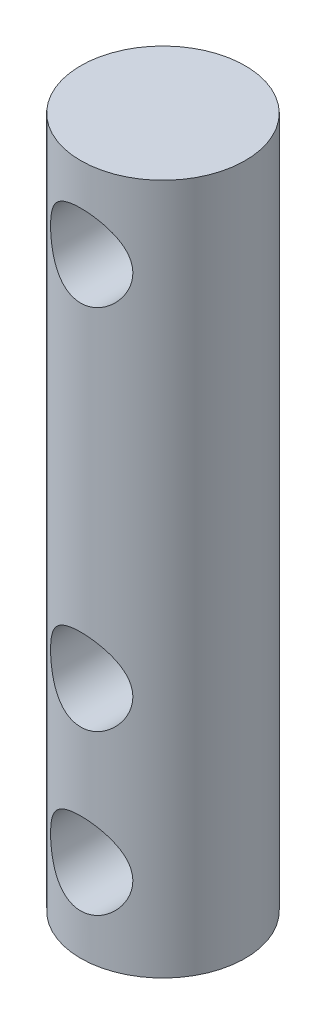
ISO-10303-21;
HEADER;
FILE_DESCRIPTION(('STEP AP214'),'2;1');
FILE_NAME('part.step','',(''),(''),'','','');
FILE_SCHEMA(('AUTOMOTIVE_DESIGN { 1 0 10303 214 1 1 1 1 }'));
ENDSEC;
DATA;
#1=APPLICATION_CONTEXT('core data for automotive mechanical design processes');
#2=APPLICATION_PROTOCOL_DEFINITION('international standard','automotive_design',2000,#1);
#3=PRODUCT_CONTEXT('',#1,'mechanical');
#4=PRODUCT('Part','Part','',(#3));
#5=PRODUCT_RELATED_PRODUCT_CATEGORY('part','',(#4));
#6=PRODUCT_DEFINITION_FORMATION('','',#4);
#7=PRODUCT_DEFINITION_CONTEXT('part definition',#1,'design');
#8=PRODUCT_DEFINITION('design','',#6,#7);
#9=PRODUCT_DEFINITION_SHAPE('','',#8);
#10=(LENGTH_UNIT() NAMED_UNIT(*) SI_UNIT(.MILLI.,.METRE.));
#11=(NAMED_UNIT(*) PLANE_ANGLE_UNIT() SI_UNIT($,.RADIAN.));
#12=(NAMED_UNIT(*) SI_UNIT($,.STERADIAN.) SOLID_ANGLE_UNIT());
#13=UNCERTAINTY_MEASURE_WITH_UNIT(LENGTH_MEASURE(1.E-05),#10,'distance_accuracy_value','');
#14=(GEOMETRIC_REPRESENTATION_CONTEXT(3) GLOBAL_UNCERTAINTY_ASSIGNED_CONTEXT((#13)) GLOBAL_UNIT_ASSIGNED_CONTEXT((#10,
#11,#12)) REPRESENTATION_CONTEXT('',''));
#15=CARTESIAN_POINT('',(0.,0.,0.));
#16=DIRECTION('',(0.,0.,1.));
#17=DIRECTION('',(1.,0.,0.));
#18=AXIS2_PLACEMENT_3D('',#15,#16,#17);
#19=CARTESIAN_POINT('',(0.,21.,0.));
#20=DIRECTION('',(0.,-1.,0.));
#21=DIRECTION('',(0.,0.,-1.));
#22=AXIS2_PLACEMENT_3D('',#19,#20,#21);
#23=CYLINDRICAL_SURFACE('',#22,2.5);
#24=CARTESIAN_POINT('',(0.,19.75,-2.5));
#25=CARTESIAN_POINT('',(-0.0657149536912332,19.7499958721006,-2.49999641755189));
#26=CARTESIAN_POINT('',(-0.131508249622541,19.7447874085979,-2.49738113774397));
#27=CARTESIAN_POINT('',(-0.261150294085531,19.7241838995739,-2.48717695046745));
#28=CARTESIAN_POINT('',(-0.32499510839188,19.7087695087529,-2.47957859786229));
#29=CARTESIAN_POINT('',(-0.448666931100719,19.668507739229,-2.46020349254139));
#30=CARTESIAN_POINT('',(-0.508508503673976,19.64369701969,-2.448442989719));
#31=CARTESIAN_POINT('',(-0.623090771008207,19.5855367232938,-2.42182220644723));
#32=CARTESIAN_POINT('',(-0.677831867487563,19.5521878196889,-2.40696217041912));
#33=CARTESIAN_POINT('',(-0.7843847722024,19.4756034381434,-2.37445322822571));
#34=CARTESIAN_POINT('',(-0.835819013902642,19.4318919009505,-2.3566899890942));
#35=CARTESIAN_POINT('',(-0.930974306083724,19.3368481509412,-2.3207496280843));
#36=CARTESIAN_POINT('',(-0.974689478883459,19.2855101852845,-2.30257220261294));
#37=CARTESIAN_POINT('',(-1.05656500056285,19.1718958130958,-2.26623688996684));
#38=CARTESIAN_POINT('',(-1.09403166943955,19.1090798770676,-2.24818983712665));
#39=CARTESIAN_POINT('',(-1.15771028361337,18.9770408300172,-2.21607473465401));
#40=CARTESIAN_POINT('',(-1.18393026870792,18.9078223390966,-2.20200384508737));
#41=CARTESIAN_POINT('',(-1.22266555273574,18.7691686182226,-2.18072333797261));
#42=CARTESIAN_POINT('',(-1.23590732135055,18.6999944349158,-2.17315339479642));
#43=CARTESIAN_POINT('',(-1.25053374163606,18.5600264527757,-2.1647736243566));
#44=CARTESIAN_POINT('',(-1.25193011046634,18.4892343239111,-2.1639571167911));
#45=CARTESIAN_POINT('',(-1.24335910896537,18.3571424696058,-2.1688866282156));
#46=CARTESIAN_POINT('',(-1.23473069942103,18.2957199609712,-2.17385954577517));
#47=CARTESIAN_POINT('',(-1.20867481132117,18.1753476132837,-2.18845285917313));
#48=CARTESIAN_POINT('',(-1.19124452987206,18.1163985683684,-2.1980747353972));
#49=CARTESIAN_POINT('',(-1.1477622254825,18.0009635842929,-2.22109345515926));
#50=CARTESIAN_POINT('',(-1.12151883389499,17.9445670015178,-2.23457300829998));
#51=CARTESIAN_POINT('',(-1.061302109585,17.8367071342625,-2.26379255351755));
#52=CARTESIAN_POINT('',(-1.02732530476558,17.7852460804999,-2.27953355975238));
#53=CARTESIAN_POINT('',(-0.947582568640986,17.681848434071,-2.31391447379107));
#54=CARTESIAN_POINT('',(-0.900868072961603,17.6306789080298,-2.33266887795933));
#55=CARTESIAN_POINT('',(-0.799444473426718,17.5365807267614,-2.36934529125509));
#56=CARTESIAN_POINT('',(-0.744731570717857,17.4936560099577,-2.38726689948501));
#57=CARTESIAN_POINT('',(-0.62564563228981,17.4153929237128,-2.42127484103705));
#58=CARTESIAN_POINT('',(-0.56094198949926,17.3804994094428,-2.43723730202509));
#59=CARTESIAN_POINT('',(-0.425582769360995,17.3223787136962,-2.46447351401553));
#60=CARTESIAN_POINT('',(-0.354931970331595,17.299142268731,-2.47575098679441));
#61=CARTESIAN_POINT('',(-0.215958114575878,17.2669057453542,-2.49155417176795));
#62=CARTESIAN_POINT('',(-0.147926913185406,17.2568859553165,-2.4965617287664));
#63=CARTESIAN_POINT('',(-0.0109744999366928,17.2481690860819,-2.50091266823877));
#64=CARTESIAN_POINT('',(0.057946274837376,17.2494666429507,-2.5002587340164));
#65=CARTESIAN_POINT('',(0.189041214982491,17.2627583605234,-2.49363990316801));
#66=CARTESIAN_POINT('',(0.251324260062443,17.2739156659125,-2.48809057110237));
#67=CARTESIAN_POINT('',(0.373008615377396,17.3052975898689,-2.47277714143524));
#68=CARTESIAN_POINT('',(0.432409607113746,17.3255232080667,-2.46301257917916));
#69=CARTESIAN_POINT('',(0.548610760562081,17.3749980830415,-2.43980314267087));
#70=CARTESIAN_POINT('',(0.605287996257691,17.404488812646,-2.42626102212424));
#71=CARTESIAN_POINT('',(0.713076702123651,17.4713844195576,-2.39679967896386));
#72=CARTESIAN_POINT('',(0.764185787219103,17.5087926682418,-2.38087944457231));
#73=CARTESIAN_POINT('',(0.864709611613317,17.5947005316661,-2.3463527667183));
#74=CARTESIAN_POINT('',(0.913465097280799,17.643928585567,-2.32763606060552));
#75=CARTESIAN_POINT('',(1.00232040139155,17.7499064390866,-2.29077989504843));
#76=CARTESIAN_POINT('',(1.04241423211355,17.8066613985205,-2.27264084226908));
#77=CARTESIAN_POINT('',(1.11463489312212,17.9295545677504,-2.23813990282585));
#78=CARTESIAN_POINT('',(1.1462818698483,17.9960140827607,-2.2219066207934));
#79=CARTESIAN_POINT('',(1.19760353251725,18.1343875846157,-2.19467590460158));
#80=CARTESIAN_POINT('',(1.21729364485946,18.2062944081265,-2.18367172800772));
#81=CARTESIAN_POINT('',(1.2423271093121,18.3461377785768,-2.16951876260833));
#82=CARTESIAN_POINT('',(1.24886624550108,18.4137928167863,-2.16571729325614));
#83=CARTESIAN_POINT('',(1.25086144297599,18.5493088339634,-2.16456693307719));
#84=CARTESIAN_POINT('',(1.2463223082805,18.6171697109243,-2.16721524534441));
#85=CARTESIAN_POINT('',(1.22740765699033,18.744354376915,-2.17797327562531));
#86=CARTESIAN_POINT('',(1.2140103929285,18.8038755876805,-2.18553868102992));
#87=CARTESIAN_POINT('',(1.17896919778081,18.9197601492809,-2.20463770234897));
#88=CARTESIAN_POINT('',(1.15732261394976,18.976122477615,-2.21617259462094));
#89=CARTESIAN_POINT('',(1.10476968162585,19.0882810637333,-2.2428566295566));
#90=CARTESIAN_POINT('',(1.07333892227057,19.1437848772871,-2.25819652995238));
#91=CARTESIAN_POINT('',(1.0026887145458,19.2490931702257,-2.29044164543238));
#92=CARTESIAN_POINT('',(0.963465214048313,19.2988946631481,-2.30734767243152));
#93=CARTESIAN_POINT('',(0.872754158330804,19.397677477947,-2.34327903949141));
#94=CARTESIAN_POINT('',(0.820355528762717,19.4458238779524,-2.36231229139336));
#95=CARTESIAN_POINT('',(0.707693507775352,19.5328287292795,-2.39847190318859));
#96=CARTESIAN_POINT('',(0.647425904070984,19.5716821742829,-2.4155972326005));
#97=CARTESIAN_POINT('',(0.519914496024935,19.6390454534528,-2.44622511981379));
#98=CARTESIAN_POINT('',(0.452624379918269,19.6674802117643,-2.45970120703636));
#99=CARTESIAN_POINT('',(0.31342762661774,19.7122602098987,-2.48126676704332));
#100=CARTESIAN_POINT('',(0.241534749528959,19.728639808537,-2.48937154216165));
#101=CARTESIAN_POINT('',(0.140752433104231,19.7423717638448,-2.49619327387079));
#102=CARTESIAN_POINT('',(0.112702349299375,19.7452283010795,-2.49761706674002));
#103=CARTESIAN_POINT('',(0.0564396647589483,19.749043331896,-2.49952121222331));
#104=CARTESIAN_POINT('',(0.0282270595592273,19.750001773089,-2.50000153879704));
#105=CARTESIAN_POINT('',(0.,19.75,-2.5));
#106=B_SPLINE_CURVE_WITH_KNOTS('',3,(#24,#25,#26,#27,#28,#29,#30,#31,#32,#33,#34,#35,#36,#37,
#38,#39,#40,#41,#42,#43,#44,#45,#46,#47,#48,#49,#50,#51,#52,#53,#54,#55,#56,#57,#58,#59,#60,#61,
#62,#63,#64,#65,#66,#67,#68,#69,#70,#71,#72,#73,#74,#75,#76,#77,#78,#79,#80,#81,#82,#83,#84,#85,
#86,#87,#88,#89,#90,#91,#92,#93,#94,#95,#96,#97,#98,#99,#100,#101,#102,#103,#104,#105),
.UNSPECIFIED.,.T.,.F.,(4,2,2,2,2,2,2,2,2,2,2,2,2,2,2,2,2,2,2,2,2,2,2,2,2,2,2,2,2,2,2,2,2,2,2,2,
2,2,2,2,4),(0.,0.197030321775366,0.394435187136497,0.591077694365374,0.78770470072696,
0.996227198397616,1.20490779706754,1.42977158038441,1.65447434872851,1.86572515175287,
2.07676696661276,2.26257140511651,2.44843504907099,2.63862800210609,2.82890651575278,
3.04331176667348,3.25781918248358,3.48228777768051,3.7065777114035,3.91229113089182,
4.11790705639345,4.30758633132653,4.49728652038665,4.69241070034873,4.88761813435424,
5.10199513305524,5.3165198576929,5.54143352699593,5.76605639925972,5.96911634372967,
6.17208824825007,6.35572412805229,6.53941910979598,6.73545570969518,6.93159451423697,
7.15156553440623,7.37165479220716,7.59330017078657,7.81431135781163,7.89894100172122,
7.98357298143559),.UNSPECIFIED.);
#107=CARTESIAN_POINT('',(0.,19.75,-2.5));
#108=VERTEX_POINT('',#107);
#109=EDGE_CURVE('E10',#108,#108,#106,.T.);
#110=ORIENTED_EDGE('',*,*,#109,.T.);
#111=EDGE_LOOP('',(#110));
#112=FACE_BOUND('',#111,.T.);
#113=CARTESIAN_POINT('',(1.25,18.5,2.1650635094611));
#114=CARTESIAN_POINT('',(1.24999545384317,18.4348652397559,2.16506918410574));
#115=CARTESIAN_POINT('',(1.24487496341652,18.3696482355937,2.16804751484696));
#116=CARTESIAN_POINT('',(1.22465401237257,18.2412159191536,2.17952958065065));
#117=CARTESIAN_POINT('',(1.20953258069272,18.1780051061957,2.18804492569449));
#118=CARTESIAN_POINT('',(1.17012493587477,18.0556854195701,2.20936683256748));
#119=CARTESIAN_POINT('',(1.14588744061716,17.996556684408,2.22215054341565));
#120=CARTESIAN_POINT('',(1.08908440672047,17.8832197475041,2.25053331021072));
#121=CARTESIAN_POINT('',(1.05651841754472,17.8290118121719,2.26613251845081));
#122=CARTESIAN_POINT('',(0.980833175663598,17.7221178393031,2.29996086321802));
#123=CARTESIAN_POINT('',(0.937065045179712,17.6699260804081,2.31830079547442));
#124=CARTESIAN_POINT('',(0.841567259518083,17.5732395144916,2.35464978482132));
#125=CARTESIAN_POINT('',(0.789833657227863,17.5287485467706,2.37265867289062));
#126=CARTESIAN_POINT('',(0.67561195426818,17.4457910610654,2.40776846191186));
#127=CARTESIAN_POINT('',(0.612633986265717,17.4079327901756,2.42472633022716));
#128=CARTESIAN_POINT('',(0.480196283249379,17.3435739334428,2.45438445124411));
#129=CARTESIAN_POINT('',(0.410740672672693,17.3170661798285,2.46708738979677));
#130=CARTESIAN_POINT('',(0.27255617990747,17.2781191733736,2.48600576555297));
#131=CARTESIAN_POINT('',(0.204127238111021,17.2648130920556,2.49261850276115));
#132=CARTESIAN_POINT('',(0.0657132858723097,17.2497923516562,2.50009479807584));
#133=CARTESIAN_POINT('',(-0.00427075730467368,17.2480706790054,2.50096183480737));
#134=CARTESIAN_POINT('',(-0.137290655529688,17.2559333424629,2.49703727395563));
#135=CARTESIAN_POINT('',(-0.20040149897099,17.2645475194015,2.492731198652));
#136=CARTESIAN_POINT('',(-0.324142214897903,17.2911010548808,2.47967806574684));
#137=CARTESIAN_POINT('',(-0.384771901367408,17.3090411112203,2.47093067582992));
#138=CARTESIAN_POINT('',(-0.502886739461943,17.3538532076123,2.44964479109568));
#139=CARTESIAN_POINT('',(-0.560316779393974,17.3808453914651,2.43705551911499));
#140=CARTESIAN_POINT('',(-0.669971001891661,17.4428292702519,2.40922057483359));
#141=CARTESIAN_POINT('',(-0.722193311048308,17.4778238291279,2.39397395196855));
#142=CARTESIAN_POINT('',(-0.825217076122744,17.5586191894163,2.36055492999036));
#143=CARTESIAN_POINT('',(-0.875417593786702,17.6051287854075,2.34224219997719));
#144=CARTESIAN_POINT('',(-0.967630462872227,17.7057371561627,2.30567925733514));
#145=CARTESIAN_POINT('',(-1.00963651446779,17.7598417153426,2.28742910332036));
#146=CARTESIAN_POINT('',(-1.08688166830277,17.8783102405301,2.25180195115606));
#147=CARTESIAN_POINT('',(-1.12152164372257,17.9431075288178,2.23455399988384));
#148=CARTESIAN_POINT('',(-1.17914889125154,18.0786720891988,2.2046931284822));
#149=CARTESIAN_POINT('',(-1.20214832276361,18.149433041272,2.19207537557584));
#150=CARTESIAN_POINT('',(-1.2339752637813,18.2890181391035,2.17430794771293));
#151=CARTESIAN_POINT('',(-1.24378140264997,18.3575513988044,2.1686456981062));
#152=CARTESIAN_POINT('',(-1.25189618326428,18.4955016768957,2.16397399202012));
#153=CARTESIAN_POINT('',(-1.25021294664378,18.5649180363997,2.16495983611639));
#154=CARTESIAN_POINT('',(-1.23629505417996,18.6945673982234,2.17292920675731));
#155=CARTESIAN_POINT('',(-1.22523477089059,18.7549743138849,2.17924484383318));
#156=CARTESIAN_POINT('',(-1.19462035579055,18.8729597328387,2.19617526939176));
#157=CARTESIAN_POINT('',(-1.17506347327952,18.9305373134333,2.20679145006292));
#158=CARTESIAN_POINT('',(-1.12705948575611,19.0442641636284,2.23170277599571));
#159=CARTESIAN_POINT('',(-1.09824257961591,19.1002237710669,2.24614554053829));
#160=CARTESIAN_POINT('',(-1.03285883001976,19.2068365894237,2.27695149371562));
#161=CARTESIAN_POINT('',(-0.996288005415271,19.2574870543916,2.29331566693934));
#162=CARTESIAN_POINT('',(-0.911046458998567,19.3587234594044,2.3285999807042));
#163=CARTESIAN_POINT('',(-0.861431590393709,19.4084964383971,2.34758228942861));
#164=CARTESIAN_POINT('',(-0.754255619247861,19.499265297492,2.38417793722366));
#165=CARTESIAN_POINT('',(-0.696691843319184,19.5402582127882,2.40179081259637));
#166=CARTESIAN_POINT('',(-0.573169203198447,19.6132171574376,2.43426702113696));
#167=CARTESIAN_POINT('',(-0.507028871967642,19.6449163977636,2.44904552090037));
#168=CARTESIAN_POINT('',(-0.369402955801353,19.6964223798217,2.47354193699126));
#169=CARTESIAN_POINT('',(-0.29792212674022,19.7162395642079,2.48326429595466));
#170=CARTESIAN_POINT('',(-0.158724602913022,19.7417107052183,2.49584385227353));
#171=CARTESIAN_POINT('',(-0.0912643048130714,19.7484973448451,2.49924909885239));
#172=CARTESIAN_POINT('',(0.0439074824390048,19.751054081818,2.50052662968914));
#173=CARTESIAN_POINT('',(0.111618875368859,19.7468280356545,2.49840085083612));
#174=CARTESIAN_POINT('',(0.240672490396435,19.7282294915055,2.48917461047403));
#175=CARTESIAN_POINT('',(0.302140397264081,19.7145439384279,2.48241118334987));
#176=CARTESIAN_POINT('',(0.421807440229523,19.6783412508713,2.46490117079279));
#177=CARTESIAN_POINT('',(0.480006106194387,19.6558228498832,2.45415401415995));
#178=CARTESIAN_POINT('',(0.594279257806106,19.6015911847925,2.4290741343515));
#179=CARTESIAN_POINT('',(0.650156428375059,19.5695258459902,2.41460771498499));
#180=CARTESIAN_POINT('',(0.755968302267532,19.4975525864262,2.38360166427283));
#181=CARTESIAN_POINT('',(0.805900259268635,19.4576410636054,2.36706108197951));
#182=CARTESIAN_POINT('',(0.903642505196115,19.3665035762216,2.33160762783284));
#183=CARTESIAN_POINT('',(0.95074710567409,19.3145468906535,2.31262248764622));
#184=CARTESIAN_POINT('',(1.03582910924334,19.2031865985878,2.27578845203565));
#185=CARTESIAN_POINT('',(1.07379843751257,19.1437764739154,2.25794057202332));
#186=CARTESIAN_POINT('',(1.14053884973207,19.0167041917738,2.22499506631145));
#187=CARTESIAN_POINT('',(1.16898133245117,18.9488405860891,2.21000217820338));
#188=CARTESIAN_POINT('',(1.21359838688302,18.8083344945753,2.18582695410439));
#189=CARTESIAN_POINT('',(1.22981398896918,18.7357088888591,2.17662520184627));
#190=CARTESIAN_POINT('',(1.24295875983052,18.635243305435,2.16911590752238));
#191=CARTESIAN_POINT('',(1.24559513120482,18.6082901320026,2.1676016125644));
#192=CARTESIAN_POINT('',(1.24911675636245,18.5542293991472,2.16557419859688));
#193=CARTESIAN_POINT('',(1.25000189299984,18.5271218295177,2.16506114656387));
#194=CARTESIAN_POINT('',(1.25,18.5,2.1650635094611));
#195=B_SPLINE_CURVE_WITH_KNOTS('',3,(#113,#114,#115,#116,#117,#118,#119,#120,#121,#122,#123,
#124,#125,#126,#127,#128,#129,#130,#131,#132,#133,#134,#135,#136,#137,#138,#139,#140,#141,#142,
#143,#144,#145,#146,#147,#148,#149,#150,#151,#152,#153,#154,#155,#156,#157,#158,#159,#160,#161,
#162,#163,#164,#165,#166,#167,#168,#169,#170,#171,#172,#173,#174,#175,#176,#177,#178,#179,#180,
#181,#182,#183,#184,#185,#186,#187,#188,#189,#190,#191,#192,#193,#194),.UNSPECIFIED.,.T.,.F.,(4,
2,2,2,2,2,2,2,2,2,2,2,2,2,2,2,2,2,2,2,2,2,2,2,2,2,2,2,2,2,2,2,2,2,2,2,2,2,2,2,4),(0.,
0.195290153243394,0.390991116031008,0.585660744898608,0.780340906806438,0.991077890622798,
1.20191963855464,1.42697365298455,1.65188533704864,1.86079356209919,2.0695752960755,
2.26020121855673,2.45084140646819,2.64411918413934,2.8374662418784,3.04908989321114,
3.26087560307399,3.48611052161811,3.71110967764632,3.91827863567765,4.12530116485467,
4.30967729280032,4.49411315545079,4.6870912050761,4.8801685777506,5.09758429475767,
5.31507331222753,5.53830226766208,5.76133474760965,5.96390337986859,6.16640108492465,
6.35555531089366,6.54473666890017,6.74200938399341,6.93937287625899,7.15637802312585,
7.37357428556443,7.59763436298257,7.82093916253451,7.90225168981638,7.98356965618176),.UNSPECIFIED.);
#196=CARTESIAN_POINT('',(1.25,18.5,2.1650635094611));
#197=VERTEX_POINT('',#196);
#198=EDGE_CURVE('E51',#197,#197,#195,.T.);
#199=ORIENTED_EDGE('',*,*,#198,.T.);
#200=EDGE_LOOP('',(#199));
#201=FACE_BOUND('',#200,.T.);
#202=CARTESIAN_POINT('',(0.,3.75,-2.5));
#203=CARTESIAN_POINT('',(-0.0657149536912329,3.74999587210063,-2.49999641755189));
#204=CARTESIAN_POINT('',(-0.13150824962254,3.74478740859791,-2.49738113774397));
#205=CARTESIAN_POINT('',(-0.261150294085531,3.72418389957385,-2.48717695046745));
#206=CARTESIAN_POINT('',(-0.324995108391879,3.70876950875294,-2.47957859786229));
#207=CARTESIAN_POINT('',(-0.448666931100718,3.66850773922901,-2.46020349254139));
#208=CARTESIAN_POINT('',(-0.508508503673975,3.64369701968998,-2.448442989719));
#209=CARTESIAN_POINT('',(-0.623090771008207,3.58553672329382,-2.42182220644723));
#210=CARTESIAN_POINT('',(-0.677831867487563,3.55218781968893,-2.40696217041912));
#211=CARTESIAN_POINT('',(-0.784384772202399,3.47560343814338,-2.37445322822571));
#212=CARTESIAN_POINT('',(-0.83581901390264,3.43189190095045,-2.3566899890942));
#213=CARTESIAN_POINT('',(-0.930974306083722,3.33684815094121,-2.3207496280843));
#214=CARTESIAN_POINT('',(-0.974689478883458,3.28551018528445,-2.30257220261294));
#215=CARTESIAN_POINT('',(-1.05656500056285,3.17189581309577,-2.26623688996684));
#216=CARTESIAN_POINT('',(-1.09403166943955,3.10907987706761,-2.24818983712665));
#217=CARTESIAN_POINT('',(-1.15771028361337,2.97704083001723,-2.21607473465401));
#218=CARTESIAN_POINT('',(-1.18393026870792,2.90782233909656,-2.20200384508737));
#219=CARTESIAN_POINT('',(-1.22266555273574,2.7691686182226,-2.18072333797261));
#220=CARTESIAN_POINT('',(-1.23590732135055,2.69999443491576,-2.17315339479642));
#221=CARTESIAN_POINT('',(-1.25053374163606,2.56002645277565,-2.1647736243566));
#222=CARTESIAN_POINT('',(-1.25193011046634,2.48923432391105,-2.1639571167911));
#223=CARTESIAN_POINT('',(-1.24335910896537,2.35714246960579,-2.16888662821561));
#224=CARTESIAN_POINT('',(-1.23473069942103,2.29571996097118,-2.17385954577517));
#225=CARTESIAN_POINT('',(-1.20867481132117,2.1753476132837,-2.18845285917313));
#226=CARTESIAN_POINT('',(-1.19124452987206,2.11639856836835,-2.1980747353972));
#227=CARTESIAN_POINT('',(-1.1477622254825,2.00096358429292,-2.22109345515926));
#228=CARTESIAN_POINT('',(-1.12151883389499,1.94456700151776,-2.23457300829998));
#229=CARTESIAN_POINT('',(-1.061302109585,1.83670713426249,-2.26379255351755));
#230=CARTESIAN_POINT('',(-1.02732530476558,1.78524608049989,-2.27953355975238));
#231=CARTESIAN_POINT('',(-0.947582568640986,1.68184843407097,-2.31391447379107));
#232=CARTESIAN_POINT('',(-0.900868072961602,1.6306789080298,-2.33266887795933));
#233=CARTESIAN_POINT('',(-0.799444473426717,1.53658072676137,-2.36934529125509));
#234=CARTESIAN_POINT('',(-0.744731570717857,1.49365600995765,-2.38726689948501));
#235=CARTESIAN_POINT('',(-0.625645632289811,1.41539292371284,-2.42127484103705));
#236=CARTESIAN_POINT('',(-0.560941989499261,1.38049940944282,-2.43723730202509));
#237=CARTESIAN_POINT('',(-0.425582769360997,1.32237871369624,-2.46447351401553));
#238=CARTESIAN_POINT('',(-0.354931970331596,1.29914226873104,-2.47575098679441));
#239=CARTESIAN_POINT('',(-0.215958114575878,1.26690574535415,-2.49155417176795));
#240=CARTESIAN_POINT('',(-0.147926913185406,1.25688595531653,-2.4965617287664));
#241=CARTESIAN_POINT('',(-0.0109744999366926,1.24816908608189,-2.50091266823877));
#242=CARTESIAN_POINT('',(0.0579462748373762,1.24946664295065,-2.5002587340164));
#243=CARTESIAN_POINT('',(0.189041214982492,1.26275836052344,-2.49363990316801));
#244=CARTESIAN_POINT('',(0.251324260062443,1.27391566591254,-2.48809057110237));
#245=CARTESIAN_POINT('',(0.373008615377396,1.30529758986885,-2.47277714143524));
#246=CARTESIAN_POINT('',(0.432409607113746,1.3255232080667,-2.46301257917916));
#247=CARTESIAN_POINT('',(0.548610760562082,1.37499808304146,-2.43980314267087));
#248=CARTESIAN_POINT('',(0.605287996257692,1.40448881264601,-2.42626102212424));
#249=CARTESIAN_POINT('',(0.713076702123652,1.47138441955755,-2.39679967896386));
#250=CARTESIAN_POINT('',(0.764185787219103,1.50879266824179,-2.38087944457231));
#251=CARTESIAN_POINT('',(0.864709611613317,1.59470053166609,-2.3463527667183));
#252=CARTESIAN_POINT('',(0.913465097280799,1.64392858556695,-2.32763606060552));
#253=CARTESIAN_POINT('',(1.00232040139155,1.74990643908663,-2.29077989504843));
#254=CARTESIAN_POINT('',(1.04241423211355,1.80666139852047,-2.27264084226908));
#255=CARTESIAN_POINT('',(1.11463489312212,1.92955456775039,-2.23813990282585));
#256=CARTESIAN_POINT('',(1.1462818698483,1.99601408276074,-2.2219066207934));
#257=CARTESIAN_POINT('',(1.19760353251725,2.13438758461565,-2.19467590460158));
#258=CARTESIAN_POINT('',(1.21729364485946,2.20629440812648,-2.18367172800773));
#259=CARTESIAN_POINT('',(1.2423271093121,2.34613777857681,-2.16951876260833));
#260=CARTESIAN_POINT('',(1.24886624550108,2.41379281678629,-2.16571729325614));
#261=CARTESIAN_POINT('',(1.25086144297598,2.54930883396341,-2.16456693307719));
#262=CARTESIAN_POINT('',(1.2463223082805,2.61716971092429,-2.16721524534441));
#263=CARTESIAN_POINT('',(1.22740765699033,2.74435437691502,-2.17797327562531));
#264=CARTESIAN_POINT('',(1.2140103929285,2.8038755876805,-2.18553868102992));
#265=CARTESIAN_POINT('',(1.17896919778081,2.91976014928088,-2.20463770234897));
#266=CARTESIAN_POINT('',(1.15732261394976,2.97612247761496,-2.21617259462094));
#267=CARTESIAN_POINT('',(1.10476968162585,3.08828106373326,-2.2428566295566));
#268=CARTESIAN_POINT('',(1.07333892227057,3.14378487728712,-2.25819652995238));
#269=CARTESIAN_POINT('',(1.00268871454579,3.24909317022573,-2.29044164543238));
#270=CARTESIAN_POINT('',(0.963465214048311,3.29889466314811,-2.30734767243153));
#271=CARTESIAN_POINT('',(0.872754158330802,3.39767747794702,-2.34327903949141));
#272=CARTESIAN_POINT('',(0.820355528762715,3.4458238779524,-2.36231229139336));
#273=CARTESIAN_POINT('',(0.70769350777535,3.53282872927954,-2.3984719031886));
#274=CARTESIAN_POINT('',(0.647425904070982,3.57168217428286,-2.4155972326005));
#275=CARTESIAN_POINT('',(0.519914496024934,3.63904545345275,-2.44622511981379));
#276=CARTESIAN_POINT('',(0.452624379918268,3.66748021176429,-2.45970120703636));
#277=CARTESIAN_POINT('',(0.313427626617739,3.71226020989869,-2.48126676704332));
#278=CARTESIAN_POINT('',(0.241534749528957,3.72863980853697,-2.48937154216165));
#279=CARTESIAN_POINT('',(0.140752433104229,3.74237176384481,-2.49619327387079));
#280=CARTESIAN_POINT('',(0.112702349299373,3.74522830107952,-2.49761706674002));
#281=CARTESIAN_POINT('',(0.056439664758947,3.74904333189601,-2.49952121222331));
#282=CARTESIAN_POINT('',(0.0282270595592267,3.750001773089,-2.50000153879704));
#283=CARTESIAN_POINT('',(0.,3.75,-2.5));
#284=B_SPLINE_CURVE_WITH_KNOTS('',3,(#202,#203,#204,#205,#206,#207,#208,#209,#210,#211,#212,
#213,#214,#215,#216,#217,#218,#219,#220,#221,#222,#223,#224,#225,#226,#227,#228,#229,#230,#231,
#232,#233,#234,#235,#236,#237,#238,#239,#240,#241,#242,#243,#244,#245,#246,#247,#248,#249,#250,
#251,#252,#253,#254,#255,#256,#257,#258,#259,#260,#261,#262,#263,#264,#265,#266,#267,#268,#269,
#270,#271,#272,#273,#274,#275,#276,#277,#278,#279,#280,#281,#282,#283),.UNSPECIFIED.,.T.,.F.,(4,
2,2,2,2,2,2,2,2,2,2,2,2,2,2,2,2,2,2,2,2,2,2,2,2,2,2,2,2,2,2,2,2,2,2,2,2,2,2,2,4),(0.,
0.197030321775365,0.394435187136497,0.591077694365374,0.78770470072696,0.996227198397611,
1.20490779706754,1.42977158038441,1.65447434872851,1.86572515175287,2.07676696661276,
2.26257140511651,2.44843504907098,2.63862800210609,2.82890651575277,3.04331176667348,
3.25781918248358,3.48228777768051,3.70657771140349,3.91229113089182,4.11790705639345,
4.30758633132653,4.49728652038664,4.69241070034873,4.88761813435424,5.10199513305524,
5.3165198576929,5.54143352699593,5.76605639925972,5.96911634372967,6.17208824825007,
6.35572412805228,6.53941910979598,6.73545570969518,6.93159451423697,7.15156553440623,
7.37165479220716,7.59330017078657,7.81431135781163,7.89894100172122,7.98357298143559),.UNSPECIFIED.);
#285=CARTESIAN_POINT('',(0.,3.75,-2.5));
#286=VERTEX_POINT('',#285);
#287=EDGE_CURVE('E58',#286,#286,#284,.T.);
#288=ORIENTED_EDGE('',*,*,#287,.T.);
#289=EDGE_LOOP('',(#288));
#290=FACE_BOUND('',#289,.T.);
#291=CARTESIAN_POINT('',(1.25,2.5,2.1650635094611));
#292=CARTESIAN_POINT('',(1.24999545384316,2.43486523975594,2.16506918410574));
#293=CARTESIAN_POINT('',(1.24487496341652,2.36964823559369,2.16804751484696));
#294=CARTESIAN_POINT('',(1.22465401237257,2.24121591915356,2.17952958065065));
#295=CARTESIAN_POINT('',(1.20953258069272,2.17800510619574,2.18804492569449));
#296=CARTESIAN_POINT('',(1.17012493587477,2.05568541957007,2.20936683256748));
#297=CARTESIAN_POINT('',(1.14588744061716,1.99655668440802,2.22215054341565));
#298=CARTESIAN_POINT('',(1.08908440672047,1.8832197475041,2.25053331021072));
#299=CARTESIAN_POINT('',(1.05651841754472,1.82901181217193,2.26613251845081));
#300=CARTESIAN_POINT('',(0.9808331756636,1.72211783930312,2.29996086321802));
#301=CARTESIAN_POINT('',(0.937065045179714,1.66992608040807,2.31830079547442));
#302=CARTESIAN_POINT('',(0.841567259518087,1.57323951449161,2.35464978482132));
#303=CARTESIAN_POINT('',(0.789833657227868,1.5287485467706,2.37265867289062));
#304=CARTESIAN_POINT('',(0.675611954268185,1.44579106106542,2.40776846191186));
#305=CARTESIAN_POINT('',(0.612633986265721,1.40793279017559,2.42472633022716));
#306=CARTESIAN_POINT('',(0.480196283249382,1.3435739334428,2.45438445124411));
#307=CARTESIAN_POINT('',(0.410740672672696,1.31706617982854,2.46708738979677));
#308=CARTESIAN_POINT('',(0.272556179907474,1.27811917337363,2.48600576555297));
#309=CARTESIAN_POINT('',(0.204127238111024,1.26481309205558,2.49261850276115));
#310=CARTESIAN_POINT('',(0.0657132858723123,1.2497923516562,2.50009479807584));
#311=CARTESIAN_POINT('',(-0.00427075730467107,1.24807067900536,2.50096183480737));
#312=CARTESIAN_POINT('',(-0.137290655529686,1.25593334246293,2.49703727395563));
#313=CARTESIAN_POINT('',(-0.200401498970988,1.26454751940153,2.492731198652));
#314=CARTESIAN_POINT('',(-0.324142214897901,1.29110105488082,2.47967806574684));
#315=CARTESIAN_POINT('',(-0.384771901367405,1.30904111122028,2.47093067582992));
#316=CARTESIAN_POINT('',(-0.502886739461941,1.35385320761226,2.44964479109568));
#317=CARTESIAN_POINT('',(-0.560316779393972,1.38084539146508,2.43705551911499));
#318=CARTESIAN_POINT('',(-0.66997100189166,1.44282927025186,2.40922057483359));
#319=CARTESIAN_POINT('',(-0.722193311048306,1.47782382912794,2.39397395196855));
#320=CARTESIAN_POINT('',(-0.825217076122743,1.55861918941627,2.36055492999036));
#321=CARTESIAN_POINT('',(-0.8754175937867,1.60512878540751,2.34224219997719));
#322=CARTESIAN_POINT('',(-0.967630462872225,1.70573715616272,2.30567925733515));
#323=CARTESIAN_POINT('',(-1.00963651446779,1.75984171534258,2.28742910332036));
#324=CARTESIAN_POINT('',(-1.08688166830276,1.87831024053011,2.25180195115606));
#325=CARTESIAN_POINT('',(-1.12152164372256,1.94310752881776,2.23455399988384));
#326=CARTESIAN_POINT('',(-1.17914889125154,2.07867208919874,2.2046931284822));
#327=CARTESIAN_POINT('',(-1.20214832276361,2.14943304127195,2.19207537557584));
#328=CARTESIAN_POINT('',(-1.2339752637813,2.28901813910348,2.17430794771293));
#329=CARTESIAN_POINT('',(-1.24378140264997,2.35755139880444,2.1686456981062));
#330=CARTESIAN_POINT('',(-1.25189618326428,2.49550167689567,2.16397399202012));
#331=CARTESIAN_POINT('',(-1.25021294664378,2.56491803639973,2.16495983611639));
#332=CARTESIAN_POINT('',(-1.23629505417996,2.69456739822341,2.17292920675731));
#333=CARTESIAN_POINT('',(-1.22523477089058,2.75497431388491,2.17924484383318));
#334=CARTESIAN_POINT('',(-1.19462035579055,2.87295973283869,2.19617526939176));
#335=CARTESIAN_POINT('',(-1.17506347327952,2.93053731343326,2.20679145006292));
#336=CARTESIAN_POINT('',(-1.12705948575611,3.04426416362837,2.23170277599571));
#337=CARTESIAN_POINT('',(-1.09824257961591,3.10022377106694,2.24614554053829));
#338=CARTESIAN_POINT('',(-1.03285883001976,3.20683658942374,2.27695149371562));
#339=CARTESIAN_POINT('',(-0.996288005415272,3.2574870543916,2.29331566693934));
#340=CARTESIAN_POINT('',(-0.911046458998569,3.35872345940443,2.3285999807042));
#341=CARTESIAN_POINT('',(-0.86143159039371,3.40849643839707,2.34758228942861));
#342=CARTESIAN_POINT('',(-0.754255619247863,3.49926529749199,2.38417793722366));
#343=CARTESIAN_POINT('',(-0.696691843319185,3.54025821278817,2.40179081259636));
#344=CARTESIAN_POINT('',(-0.573169203198448,3.61321715743763,2.43426702113696));
#345=CARTESIAN_POINT('',(-0.507028871967643,3.64491639776364,2.44904552090036));
#346=CARTESIAN_POINT('',(-0.369402955801354,3.69642237982174,2.47354193699126));
#347=CARTESIAN_POINT('',(-0.297922126740222,3.71623956420788,2.48326429595466));
#348=CARTESIAN_POINT('',(-0.158724602913023,3.74171070521833,2.49584385227353));
#349=CARTESIAN_POINT('',(-0.0912643048130728,3.74849734484514,2.49924909885239));
#350=CARTESIAN_POINT('',(0.0439074824390029,3.751054081818,2.50052662968914));
#351=CARTESIAN_POINT('',(0.111618875368857,3.74682803565445,2.49840085083612));
#352=CARTESIAN_POINT('',(0.240672490396433,3.72822949150547,2.48917461047403));
#353=CARTESIAN_POINT('',(0.302140397264079,3.71454393842791,2.48241118334987));
#354=CARTESIAN_POINT('',(0.421807440229521,3.67834125087129,2.46490117079279));
#355=CARTESIAN_POINT('',(0.480006106194385,3.65582284988318,2.45415401415995));
#356=CARTESIAN_POINT('',(0.594279257806104,3.60159118479253,2.4290741343515));
#357=CARTESIAN_POINT('',(0.650156428375056,3.5695258459902,2.41460771498499));
#358=CARTESIAN_POINT('',(0.755968302267529,3.49755258642619,2.38360166427283));
#359=CARTESIAN_POINT('',(0.805900259268632,3.45764106360541,2.36706108197951));
#360=CARTESIAN_POINT('',(0.903642505196113,3.36650357622162,2.33160762783285));
#361=CARTESIAN_POINT('',(0.950747105674088,3.31454689065351,2.31262248764622));
#362=CARTESIAN_POINT('',(1.03582910924334,3.20318659858779,2.27578845203565));
#363=CARTESIAN_POINT('',(1.07379843751257,3.1437764739154,2.25794057202332));
#364=CARTESIAN_POINT('',(1.14053884973207,3.01670419177381,2.22499506631145));
#365=CARTESIAN_POINT('',(1.16898133245117,2.94884058608908,2.21000217820338));
#366=CARTESIAN_POINT('',(1.21359838688301,2.80833449457528,2.18582695410439));
#367=CARTESIAN_POINT('',(1.22981398896918,2.73570888885914,2.17662520184627));
#368=CARTESIAN_POINT('',(1.24295875983052,2.63524330543501,2.16911590752238));
#369=CARTESIAN_POINT('',(1.24559513120481,2.60829013200265,2.1676016125644));
#370=CARTESIAN_POINT('',(1.24911675636245,2.5542293991472,2.16557419859688));
#371=CARTESIAN_POINT('',(1.25000189299984,2.52712182951766,2.16506114656387));
#372=CARTESIAN_POINT('',(1.25,2.5,2.1650635094611));
#373=B_SPLINE_CURVE_WITH_KNOTS('',3,(#291,#292,#293,#294,#295,#296,#297,#298,#299,#300,#301,
#302,#303,#304,#305,#306,#307,#308,#309,#310,#311,#312,#313,#314,#315,#316,#317,#318,#319,#320,
#321,#322,#323,#324,#325,#326,#327,#328,#329,#330,#331,#332,#333,#334,#335,#336,#337,#338,#339,
#340,#341,#342,#343,#344,#345,#346,#347,#348,#349,#350,#351,#352,#353,#354,#355,#356,#357,#358,
#359,#360,#361,#362,#363,#364,#365,#366,#367,#368,#369,#370,#371,#372),.UNSPECIFIED.,.T.,.F.,(4,
2,2,2,2,2,2,2,2,2,2,2,2,2,2,2,2,2,2,2,2,2,2,2,2,2,2,2,2,2,2,2,2,2,2,2,2,2,2,2,4),(0.,
0.195290153243394,0.390991116031005,0.585660744898606,0.780340906806436,0.991077890622791,
1.20191963855464,1.42697365298454,1.65188533704864,1.86079356209919,2.0695752960755,
2.26020121855673,2.45084140646819,2.64411918413933,2.8374662418784,3.04908989321113,
3.26087560307398,3.4861105216181,3.71110967764631,3.91827863567765,4.12530116485466,
4.30967729280032,4.49411315545079,4.6870912050761,4.88016857775059,5.09758429475766,
5.31507331222753,5.53830226766207,5.76133474760965,5.96390337986859,6.16640108492465,
6.35555531089366,6.54473666890016,6.7420093839934,6.93937287625899,7.15637802312584,
7.37357428556443,7.59763436298256,7.8209391625345,7.90225168981637,7.98356965618176),.UNSPECIFIED.);
#374=CARTESIAN_POINT('',(1.25,2.5,2.1650635094611));
#375=VERTEX_POINT('',#374);
#376=EDGE_CURVE('E64',#375,#375,#373,.T.);
#377=ORIENTED_EDGE('',*,*,#376,.T.);
#378=EDGE_LOOP('',(#377));
#379=FACE_BOUND('',#378,.T.);
#380=CARTESIAN_POINT('',(0.,8.59,-2.5));
#381=CARTESIAN_POINT('',(-0.0657149536912331,8.58999587210062,-2.49999641755189));
#382=CARTESIAN_POINT('',(-0.131508249622541,8.58478740859791,-2.49738113774397));
#383=CARTESIAN_POINT('',(-0.261150294085531,8.56418389957385,-2.48717695046745));
#384=CARTESIAN_POINT('',(-0.32499510839188,8.54876950875294,-2.47957859786229));
#385=CARTESIAN_POINT('',(-0.448666931100718,8.50850773922901,-2.46020349254139));
#386=CARTESIAN_POINT('',(-0.508508503673975,8.48369701968999,-2.448442989719));
#387=CARTESIAN_POINT('',(-0.623090771008206,8.42553672329382,-2.42182220644723));
#388=CARTESIAN_POINT('',(-0.677831867487562,8.39218781968894,-2.40696217041912));
#389=CARTESIAN_POINT('',(-0.784384772202398,8.31560343814338,-2.37445322822571));
#390=CARTESIAN_POINT('',(-0.83581901390264,8.27189190095045,-2.3566899890942));
#391=CARTESIAN_POINT('',(-0.930974306083722,8.17684815094121,-2.3207496280843));
#392=CARTESIAN_POINT('',(-0.974689478883458,8.12551018528445,-2.30257220261294));
#393=CARTESIAN_POINT('',(-1.05656500056285,8.01189581309577,-2.26623688996684));
#394=CARTESIAN_POINT('',(-1.09403166943955,7.94907987706761,-2.24818983712665));
#395=CARTESIAN_POINT('',(-1.15771028361337,7.81704083001723,-2.21607473465401));
#396=CARTESIAN_POINT('',(-1.18393026870792,7.74782233909656,-2.20200384508737));
#397=CARTESIAN_POINT('',(-1.22266555273574,7.6091686182226,-2.18072333797261));
#398=CARTESIAN_POINT('',(-1.23590732135055,7.53999443491576,-2.17315339479642));
#399=CARTESIAN_POINT('',(-1.25053374163606,7.40002645277566,-2.1647736243566));
#400=CARTESIAN_POINT('',(-1.25193011046634,7.32923432391106,-2.1639571167911));
#401=CARTESIAN_POINT('',(-1.24335910896537,7.19714246960579,-2.1688866282156));
#402=CARTESIAN_POINT('',(-1.23473069942103,7.13571996097119,-2.17385954577517));
#403=CARTESIAN_POINT('',(-1.20867481132117,7.0153476132837,-2.18845285917313));
#404=CARTESIAN_POINT('',(-1.19124452987206,6.95639856836836,-2.1980747353972));
#405=CARTESIAN_POINT('',(-1.1477622254825,6.84096358429293,-2.22109345515926));
#406=CARTESIAN_POINT('',(-1.12151883389499,6.78456700151776,-2.23457300829998));
#407=CARTESIAN_POINT('',(-1.061302109585,6.67670713426249,-2.26379255351755));
#408=CARTESIAN_POINT('',(-1.02732530476558,6.62524608049989,-2.27953355975238));
#409=CARTESIAN_POINT('',(-0.947582568640986,6.52184843407097,-2.31391447379107));
#410=CARTESIAN_POINT('',(-0.900868072961602,6.4706789080298,-2.33266887795933));
#411=CARTESIAN_POINT('',(-0.799444473426717,6.37658072676138,-2.36934529125509));
#412=CARTESIAN_POINT('',(-0.744731570717858,6.33365600995765,-2.38726689948501));
#413=CARTESIAN_POINT('',(-0.625645632289812,6.25539292371284,-2.42127484103705));
#414=CARTESIAN_POINT('',(-0.560941989499262,6.22049940944283,-2.43723730202509));
#415=CARTESIAN_POINT('',(-0.425582769360997,6.16237871369624,-2.46447351401553));
#416=CARTESIAN_POINT('',(-0.354931970331596,6.13914226873104,-2.47575098679441));
#417=CARTESIAN_POINT('',(-0.215958114575878,6.10690574535416,-2.49155417176795));
#418=CARTESIAN_POINT('',(-0.147926913185406,6.09688595531653,-2.4965617287664));
#419=CARTESIAN_POINT('',(-0.0109744999366926,6.08816908608189,-2.50091266823877));
#420=CARTESIAN_POINT('',(0.0579462748373761,6.08946664295065,-2.5002587340164));
#421=CARTESIAN_POINT('',(0.189041214982491,6.10275836052344,-2.49363990316801));
#422=CARTESIAN_POINT('',(0.251324260062442,6.11391566591254,-2.48809057110237));
#423=CARTESIAN_POINT('',(0.373008615377396,6.14529758986886,-2.47277714143524));
#424=CARTESIAN_POINT('',(0.432409607113746,6.1655232080667,-2.46301257917916));
#425=CARTESIAN_POINT('',(0.548610760562081,6.21499808304147,-2.43980314267087));
#426=CARTESIAN_POINT('',(0.605287996257692,6.24448881264602,-2.42626102212424));
#427=CARTESIAN_POINT('',(0.713076702123651,6.31138441955755,-2.39679967896386));
#428=CARTESIAN_POINT('',(0.764185787219102,6.34879266824179,-2.38087944457231));
#429=CARTESIAN_POINT('',(0.864709611613317,6.43470053166609,-2.3463527667183));
#430=CARTESIAN_POINT('',(0.913465097280799,6.48392858556696,-2.32763606060552));
#431=CARTESIAN_POINT('',(1.00232040139155,6.58990643908663,-2.29077989504843));
#432=CARTESIAN_POINT('',(1.04241423211355,6.64666139852047,-2.27264084226908));
#433=CARTESIAN_POINT('',(1.11463489312212,6.76955456775039,-2.23813990282585));
#434=CARTESIAN_POINT('',(1.1462818698483,6.83601408276074,-2.2219066207934));
#435=CARTESIAN_POINT('',(1.19760353251725,6.97438758461565,-2.19467590460158));
#436=CARTESIAN_POINT('',(1.21729364485946,7.04629440812648,-2.18367172800773));
#437=CARTESIAN_POINT('',(1.2423271093121,7.18613777857681,-2.16951876260833));
#438=CARTESIAN_POINT('',(1.24886624550108,7.2537928167863,-2.16571729325614));
#439=CARTESIAN_POINT('',(1.25086144297598,7.38930883396341,-2.16456693307719));
#440=CARTESIAN_POINT('',(1.2463223082805,7.45716971092429,-2.16721524534441));
#441=CARTESIAN_POINT('',(1.22740765699033,7.58435437691502,-2.17797327562531));
#442=CARTESIAN_POINT('',(1.2140103929285,7.6438755876805,-2.18553868102992));
#443=CARTESIAN_POINT('',(1.17896919778081,7.75976014928088,-2.20463770234897));
#444=CARTESIAN_POINT('',(1.15732261394976,7.81612247761496,-2.21617259462094));
#445=CARTESIAN_POINT('',(1.10476968162585,7.92828106373326,-2.2428566295566));
#446=CARTESIAN_POINT('',(1.07333892227057,7.98378487728713,-2.25819652995238));
#447=CARTESIAN_POINT('',(1.00268871454579,8.08909317022573,-2.29044164543238));
#448=CARTESIAN_POINT('',(0.963465214048311,8.13889466314811,-2.30734767243153));
#449=CARTESIAN_POINT('',(0.872754158330802,8.23767747794702,-2.34327903949141));
#450=CARTESIAN_POINT('',(0.820355528762715,8.2858238779524,-2.36231229139336));
#451=CARTESIAN_POINT('',(0.707693507775351,8.37282872927954,-2.3984719031886));
#452=CARTESIAN_POINT('',(0.647425904070982,8.41168217428286,-2.4155972326005));
#453=CARTESIAN_POINT('',(0.519914496024935,8.47904545345276,-2.44622511981379));
#454=CARTESIAN_POINT('',(0.452624379918269,8.50748021176429,-2.45970120703636));
#455=CARTESIAN_POINT('',(0.31342762661774,8.55226020989869,-2.48126676704332));
#456=CARTESIAN_POINT('',(0.241534749528958,8.56863980853698,-2.48937154216165));
#457=CARTESIAN_POINT('',(0.14075243310423,8.58237176384481,-2.49619327387079));
#458=CARTESIAN_POINT('',(0.112702349299374,8.58522830107952,-2.49761706674002));
#459=CARTESIAN_POINT('',(0.0564396647589478,8.58904333189601,-2.49952121222331));
#460=CARTESIAN_POINT('',(0.0282270595592271,8.590001773089,-2.50000153879704));
#461=CARTESIAN_POINT('',(0.,8.59,-2.5));
#462=B_SPLINE_CURVE_WITH_KNOTS('',3,(#380,#381,#382,#383,#384,#385,#386,#387,#388,#389,#390,
#391,#392,#393,#394,#395,#396,#397,#398,#399,#400,#401,#402,#403,#404,#405,#406,#407,#408,#409,
#410,#411,#412,#413,#414,#415,#416,#417,#418,#419,#420,#421,#422,#423,#424,#425,#426,#427,#428,
#429,#430,#431,#432,#433,#434,#435,#436,#437,#438,#439,#440,#441,#442,#443,#444,#445,#446,#447,
#448,#449,#450,#451,#452,#453,#454,#455,#456,#457,#458,#459,#460,#461),.UNSPECIFIED.,.T.,.F.,(4,
2,2,2,2,2,2,2,2,2,2,2,2,2,2,2,2,2,2,2,2,2,2,2,2,2,2,2,2,2,2,2,2,2,2,2,2,2,2,2,4),(0.,
0.197030321775366,0.394435187136497,0.591077694365374,0.787704700726959,0.996227198397611,
1.20490779706754,1.42977158038441,1.65447434872851,1.86572515175287,2.07676696661275,
2.26257140511651,2.44843504907098,2.63862800210609,2.82890651575277,3.04331176667348,
3.25781918248358,3.48228777768051,3.70657771140349,3.91229113089182,4.11790705639345,
4.30758633132652,4.49728652038664,4.69241070034873,4.88761813435424,5.10199513305524,
5.3165198576929,5.54143352699593,5.76605639925972,5.96911634372967,6.17208824825007,
6.35572412805228,6.53941910979597,6.73545570969518,6.93159451423697,7.15156553440623,
7.37165479220716,7.59330017078656,7.81431135781163,7.89894100172122,7.98357298143558),.UNSPECIFIED.);
#463=CARTESIAN_POINT('',(0.,8.59,-2.5));
#464=VERTEX_POINT('',#463);
#465=EDGE_CURVE('E94',#464,#464,#462,.T.);
#466=ORIENTED_EDGE('',*,*,#465,.T.);
#467=EDGE_LOOP('',(#466));
#468=FACE_BOUND('',#467,.T.);
#469=CARTESIAN_POINT('',(1.25,7.34,2.1650635094611));
#470=CARTESIAN_POINT('',(1.24999545384316,7.27486523975594,2.16506918410574));
#471=CARTESIAN_POINT('',(1.24487496341652,7.20964823559369,2.16804751484696));
#472=CARTESIAN_POINT('',(1.22465401237257,7.08121591915356,2.17952958065065));
#473=CARTESIAN_POINT('',(1.20953258069272,7.01800510619574,2.18804492569449));
#474=CARTESIAN_POINT('',(1.17012493587477,6.89568541957007,2.20936683256748));
#475=CARTESIAN_POINT('',(1.14588744061716,6.83655668440802,2.22215054341565));
#476=CARTESIAN_POINT('',(1.08908440672046,6.7232197475041,2.25053331021072));
#477=CARTESIAN_POINT('',(1.05651841754472,6.66901181217193,2.26613251845081));
#478=CARTESIAN_POINT('',(0.980833175663599,6.56211783930312,2.29996086321802));
#479=CARTESIAN_POINT('',(0.937065045179714,6.50992608040807,2.31830079547442));
#480=CARTESIAN_POINT('',(0.841567259518086,6.41323951449161,2.35464978482132));
#481=CARTESIAN_POINT('',(0.789833657227867,6.3687485467706,2.37265867289062));
#482=CARTESIAN_POINT('',(0.675611954268184,6.28579106106542,2.40776846191186));
#483=CARTESIAN_POINT('',(0.61263398626572,6.24793279017559,2.42472633022715));
#484=CARTESIAN_POINT('',(0.480196283249381,6.1835739334428,2.45438445124411));
#485=CARTESIAN_POINT('',(0.410740672672695,6.15706617982854,2.46708738979677));
#486=CARTESIAN_POINT('',(0.272556179907472,6.11811917337363,2.48600576555297));
#487=CARTESIAN_POINT('',(0.204127238111023,6.10481309205558,2.49261850276115));
#488=CARTESIAN_POINT('',(0.0657132858723112,6.0897923516562,2.50009479807584));
#489=CARTESIAN_POINT('',(-0.00427075730467223,6.08807067900536,2.50096183480737));
#490=CARTESIAN_POINT('',(-0.137290655529687,6.09593334246294,2.49703727395563));
#491=CARTESIAN_POINT('',(-0.200401498970989,6.10454751940153,2.492731198652));
#492=CARTESIAN_POINT('',(-0.324142214897902,6.13110105488082,2.47967806574684));
#493=CARTESIAN_POINT('',(-0.384771901367406,6.14904111122028,2.47093067582992));
#494=CARTESIAN_POINT('',(-0.502886739461942,6.19385320761227,2.44964479109568));
#495=CARTESIAN_POINT('',(-0.560316779393972,6.22084539146508,2.43705551911499));
#496=CARTESIAN_POINT('',(-0.66997100189166,6.28282927025187,2.40922057483359));
#497=CARTESIAN_POINT('',(-0.722193311048307,6.31782382912794,2.39397395196855));
#498=CARTESIAN_POINT('',(-0.825217076122743,6.39861918941627,2.36055492999036));
#499=CARTESIAN_POINT('',(-0.8754175937867,6.44512878540751,2.34224219997719));
#500=CARTESIAN_POINT('',(-0.967630462872225,6.54573715616272,2.30567925733515));
#501=CARTESIAN_POINT('',(-1.00963651446779,6.59984171534258,2.28742910332036));
#502=CARTESIAN_POINT('',(-1.08688166830276,6.71831024053011,2.25180195115606));
#503=CARTESIAN_POINT('',(-1.12152164372256,6.78310752881776,2.23455399988384));
#504=CARTESIAN_POINT('',(-1.17914889125154,6.91867208919875,2.2046931284822));
#505=CARTESIAN_POINT('',(-1.20214832276361,6.98943304127195,2.19207537557584));
#506=CARTESIAN_POINT('',(-1.2339752637813,7.12901813910349,2.17430794771293));
#507=CARTESIAN_POINT('',(-1.24378140264997,7.19755139880444,2.1686456981062));
#508=CARTESIAN_POINT('',(-1.25189618326428,7.33550167689568,2.16397399202012));
#509=CARTESIAN_POINT('',(-1.25021294664378,7.40491803639973,2.16495983611639));
#510=CARTESIAN_POINT('',(-1.23629505417996,7.53456739822341,2.17292920675731));
#511=CARTESIAN_POINT('',(-1.22523477089058,7.59497431388491,2.17924484383318));
#512=CARTESIAN_POINT('',(-1.19462035579055,7.7129597328387,2.19617526939176));
#513=CARTESIAN_POINT('',(-1.17506347327952,7.77053731343326,2.20679145006292));
#514=CARTESIAN_POINT('',(-1.12705948575611,7.88426416362837,2.23170277599571));
#515=CARTESIAN_POINT('',(-1.09824257961591,7.94022377106694,2.24614554053829));
#516=CARTESIAN_POINT('',(-1.03285883001976,8.04683658942374,2.27695149371562));
#517=CARTESIAN_POINT('',(-0.996288005415271,8.09748705439161,2.29331566693934));
#518=CARTESIAN_POINT('',(-0.911046458998567,8.19872345940444,2.3285999807042));
#519=CARTESIAN_POINT('',(-0.861431590393708,8.24849643839707,2.34758228942861));
#520=CARTESIAN_POINT('',(-0.754255619247861,8.33926529749199,2.38417793722366));
#521=CARTESIAN_POINT('',(-0.696691843319185,8.38025821278818,2.40179081259637));
#522=CARTESIAN_POINT('',(-0.573169203198448,8.45321715743763,2.43426702113696));
#523=CARTESIAN_POINT('',(-0.507028871967642,8.48491639776364,2.44904552090036));
#524=CARTESIAN_POINT('',(-0.369402955801353,8.53642237982174,2.47354193699126));
#525=CARTESIAN_POINT('',(-0.297922126740221,8.55623956420788,2.48326429595466));
#526=CARTESIAN_POINT('',(-0.158724602913022,8.58171070521833,2.49584385227353));
#527=CARTESIAN_POINT('',(-0.0912643048130718,8.58849734484514,2.49924909885239));
#528=CARTESIAN_POINT('',(0.0439074824390039,8.591054081818,2.50052662968914));
#529=CARTESIAN_POINT('',(0.111618875368858,8.58682803565446,2.49840085083612));
#530=CARTESIAN_POINT('',(0.240672490396433,8.56822949150547,2.48917461047403));
#531=CARTESIAN_POINT('',(0.302140397264079,8.55454393842791,2.48241118334987));
#532=CARTESIAN_POINT('',(0.421807440229521,8.51834125087129,2.46490117079279));
#533=CARTESIAN_POINT('',(0.480006106194385,8.49582284988318,2.45415401415995));
#534=CARTESIAN_POINT('',(0.594279257806105,8.44159118479254,2.4290741343515));
#535=CARTESIAN_POINT('',(0.650156428375057,8.4095258459902,2.41460771498499));
#536=CARTESIAN_POINT('',(0.75596830226753,8.33755258642619,2.38360166427283));
#537=CARTESIAN_POINT('',(0.805900259268633,8.29764106360541,2.36706108197951));
#538=CARTESIAN_POINT('',(0.903642505196113,8.20650357622162,2.33160762783285));
#539=CARTESIAN_POINT('',(0.950747105674089,8.15454689065351,2.31262248764622));
#540=CARTESIAN_POINT('',(1.03582910924334,8.04318659858779,2.27578845203565));
#541=CARTESIAN_POINT('',(1.07379843751257,7.9837764739154,2.25794057202332));
#542=CARTESIAN_POINT('',(1.14053884973207,7.85670419177381,2.22499506631145));
#543=CARTESIAN_POINT('',(1.16898133245117,7.78884058608908,2.21000217820338));
#544=CARTESIAN_POINT('',(1.21359838688301,7.64833449457528,2.18582695410439));
#545=CARTESIAN_POINT('',(1.22981398896918,7.57570888885915,2.17662520184627));
#546=CARTESIAN_POINT('',(1.24295875983052,7.47524330543501,2.16911590752238));
#547=CARTESIAN_POINT('',(1.24559513120481,7.44829013200265,2.1676016125644));
#548=CARTESIAN_POINT('',(1.24911675636245,7.3942293991472,2.16557419859688));
#549=CARTESIAN_POINT('',(1.25000189299984,7.36712182951766,2.16506114656387));
#550=CARTESIAN_POINT('',(1.25,7.34,2.1650635094611));
#551=B_SPLINE_CURVE_WITH_KNOTS('',3,(#469,#470,#471,#472,#473,#474,#475,#476,#477,#478,#479,
#480,#481,#482,#483,#484,#485,#486,#487,#488,#489,#490,#491,#492,#493,#494,#495,#496,#497,#498,
#499,#500,#501,#502,#503,#504,#505,#506,#507,#508,#509,#510,#511,#512,#513,#514,#515,#516,#517,
#518,#519,#520,#521,#522,#523,#524,#525,#526,#527,#528,#529,#530,#531,#532,#533,#534,#535,#536,
#537,#538,#539,#540,#541,#542,#543,#544,#545,#546,#547,#548,#549,#550),.UNSPECIFIED.,.T.,.F.,(4,
2,2,2,2,2,2,2,2,2,2,2,2,2,2,2,2,2,2,2,2,2,2,2,2,2,2,2,2,2,2,2,2,2,2,2,2,2,2,2,4),(0.,
0.195290153243395,0.390991116031006,0.585660744898608,0.780340906806436,0.991077890622792,
1.20191963855464,1.42697365298454,1.65188533704864,1.86079356209919,2.0695752960755,
2.26020121855673,2.45084140646819,2.64411918413933,2.8374662418784,3.04908989321113,
3.26087560307398,3.4861105216181,3.71110967764631,3.91827863567765,4.12530116485466,
4.30967729280032,4.49411315545079,4.6870912050761,4.88016857775059,5.09758429475767,
5.31507331222753,5.53830226766207,5.76133474760965,5.96390337986859,6.16640108492465,
6.35555531089366,6.54473666890016,6.7420093839934,6.93937287625899,7.15637802312584,
7.37357428556443,7.59763436298256,7.8209391625345,7.90225168981636,7.98356965618176),.UNSPECIFIED.);
#552=CARTESIAN_POINT('',(1.25,7.34,2.1650635094611));
#553=VERTEX_POINT('',#552);
#554=EDGE_CURVE('E101',#553,#553,#551,.T.);
#555=ORIENTED_EDGE('',*,*,#554,.T.);
#556=EDGE_LOOP('',(#555));
#557=FACE_BOUND('',#556,.T.);
#558=CARTESIAN_POINT('',(0.,21.,0.));
#559=DIRECTION('',(0.,1.,0.));
#560=DIRECTION('',(0.,0.,1.));
#561=AXIS2_PLACEMENT_3D('',#558,#559,#560);
#562=CIRCLE('',#561,2.5);
#563=CARTESIAN_POINT('',(0.,21.,2.5));
#564=VERTEX_POINT('',#563);
#565=EDGE_CURVE('E108',#564,#564,#562,.T.);
#566=ORIENTED_EDGE('',*,*,#565,.F.);
#567=EDGE_LOOP('',(#566));
#568=FACE_BOUND('',#567,.T.);
#569=CARTESIAN_POINT('',(0.,0.,0.));
#570=DIRECTION('',(0.,1.,0.));
#571=DIRECTION('',(0.,0.,1.));
#572=AXIS2_PLACEMENT_3D('',#569,#570,#571);
#573=CIRCLE('',#572,2.5);
#574=CARTESIAN_POINT('',(0.,0.,2.5));
#575=VERTEX_POINT('',#574);
#576=EDGE_CURVE('E109',#575,#575,#573,.T.);
#577=ORIENTED_EDGE('',*,*,#576,.T.);
#578=EDGE_LOOP('',(#577));
#579=FACE_BOUND('',#578,.T.);
#580=ADVANCED_FACE('F39',(#112,#201,#290,#379,#468,#557,#568,#579),#23,.T.);
#581=CARTESIAN_POINT('',(0.,21.,0.));
#582=DIRECTION('',(0.,1.,0.));
#583=DIRECTION('',(0.,0.,1.));
#584=AXIS2_PLACEMENT_3D('',#581,#582,#583);
#585=PLANE('',#584);
#586=ORIENTED_EDGE('',*,*,#565,.T.);
#587=EDGE_LOOP('',(#586));
#588=FACE_BOUND('',#587,.T.);
#589=ADVANCED_FACE('F118',(#588),#585,.T.);
#590=CARTESIAN_POINT('',(0.,0.,0.));
#591=DIRECTION('',(0.,1.,0.));
#592=DIRECTION('',(0.,0.,1.));
#593=AXIS2_PLACEMENT_3D('',#590,#591,#592);
#594=PLANE('',#593);
#595=ORIENTED_EDGE('',*,*,#576,.F.);
#596=EDGE_LOOP('',(#595));
#597=FACE_BOUND('',#596,.T.);
#598=ADVANCED_FACE('F124',(#597),#594,.F.);
#599=CARTESIAN_POINT('',(0.,7.34,-2.5));
#600=DIRECTION('',(0.,0.,1.));
#601=DIRECTION('',(1.,0.,0.));
#602=AXIS2_PLACEMENT_3D('',#599,#600,#601);
#603=CYLINDRICAL_SURFACE('',#602,1.25);
#604=ORIENTED_EDGE('',*,*,#554,.F.);
#605=EDGE_LOOP('',(#604));
#606=FACE_BOUND('',#605,.T.);
#607=ORIENTED_EDGE('',*,*,#465,.F.);
#608=EDGE_LOOP('',(#607));
#609=FACE_BOUND('',#608,.T.);
#610=ADVANCED_FACE('F83',(#606,#609),#603,.F.);
#611=CARTESIAN_POINT('',(0.,2.5,-2.5));
#612=DIRECTION('',(0.,0.,1.));
#613=DIRECTION('',(1.,0.,0.));
#614=AXIS2_PLACEMENT_3D('',#611,#612,#613);
#615=CYLINDRICAL_SURFACE('',#614,1.25);
#616=ORIENTED_EDGE('',*,*,#376,.F.);
#617=EDGE_LOOP('',(#616));
#618=FACE_BOUND('',#617,.T.);
#619=ORIENTED_EDGE('',*,*,#287,.F.);
#620=EDGE_LOOP('',(#619));
#621=FACE_BOUND('',#620,.T.);
#622=ADVANCED_FACE('F77',(#618,#621),#615,.F.);
#623=CARTESIAN_POINT('',(0.,18.5,-2.5));
#624=DIRECTION('',(0.,0.,1.));
#625=DIRECTION('',(1.,0.,0.));
#626=AXIS2_PLACEMENT_3D('',#623,#624,#625);
#627=CYLINDRICAL_SURFACE('',#626,1.25);
#628=ORIENTED_EDGE('',*,*,#198,.F.);
#629=EDGE_LOOP('',(#628));
#630=FACE_BOUND('',#629,.T.);
#631=ORIENTED_EDGE('',*,*,#109,.F.);
#632=EDGE_LOOP('',(#631));
#633=FACE_BOUND('',#632,.T.);
#634=ADVANCED_FACE('F74',(#630,#633),#627,.F.);
#635=CLOSED_SHELL('',(#580,#589,#598,#610,#622,#634));
#636=MANIFOLD_SOLID_BREP('B2',#635);
#637=ADVANCED_BREP_SHAPE_REPRESENTATION('',(#18,#636),#14);
#638=SHAPE_DEFINITION_REPRESENTATION(#9,#637);
ENDSEC;
END-ISO-10303-21;
